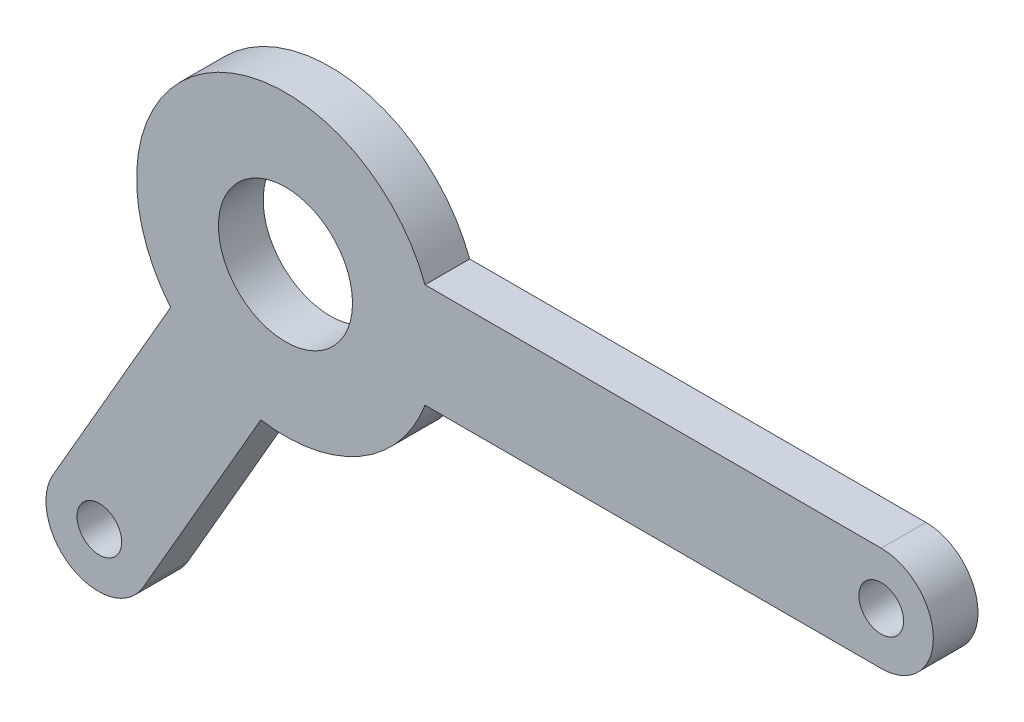
ISO-10303-21;
HEADER;
FILE_DESCRIPTION(('STEP AP214'),'2;1');
FILE_NAME('part.step','',(''),(''),'','','');
FILE_SCHEMA(('AUTOMOTIVE_DESIGN { 1 0 10303 214 1 1 1 1 }'));
ENDSEC;
DATA;
#1=APPLICATION_CONTEXT('core data for automotive mechanical design processes');
#2=APPLICATION_PROTOCOL_DEFINITION('international standard','automotive_design',2000,#1);
#3=PRODUCT_CONTEXT('',#1,'mechanical');
#4=PRODUCT('Part','Part','',(#3));
#5=PRODUCT_RELATED_PRODUCT_CATEGORY('part','',(#4));
#6=PRODUCT_DEFINITION_FORMATION('','',#4);
#7=PRODUCT_DEFINITION_CONTEXT('part definition',#1,'design');
#8=PRODUCT_DEFINITION('design','',#6,#7);
#9=PRODUCT_DEFINITION_SHAPE('','',#8);
#10=(LENGTH_UNIT() NAMED_UNIT(*) SI_UNIT(.MILLI.,.METRE.));
#11=(NAMED_UNIT(*) PLANE_ANGLE_UNIT() SI_UNIT($,.RADIAN.));
#12=(NAMED_UNIT(*) SI_UNIT($,.STERADIAN.) SOLID_ANGLE_UNIT());
#13=UNCERTAINTY_MEASURE_WITH_UNIT(LENGTH_MEASURE(1.E-05),#10,'distance_accuracy_value','');
#14=(GEOMETRIC_REPRESENTATION_CONTEXT(3) GLOBAL_UNCERTAINTY_ASSIGNED_CONTEXT((#13)) GLOBAL_UNIT_ASSIGNED_CONTEXT((#10,
#11,#12)) REPRESENTATION_CONTEXT('',''));
#15=CARTESIAN_POINT('',(0.,0.,0.));
#16=DIRECTION('',(0.,0.,1.));
#17=DIRECTION('',(1.,0.,0.));
#18=AXIS2_PLACEMENT_3D('',#15,#16,#17);
#19=CARTESIAN_POINT('',(200.,0.,15.));
#20=DIRECTION('',(0.,0.,-1.));
#21=DIRECTION('',(-1.,0.,0.));
#22=AXIS2_PLACEMENT_3D('',#19,#20,#21);
#23=PLANE('',#22);
#24=CARTESIAN_POINT('',(200.,0.,15.));
#25=DIRECTION('',(0.,0.,1.));
#26=DIRECTION('',(-1.,0.,0.));
#27=AXIS2_PLACEMENT_3D('',#24,#25,#26);
#28=CIRCLE('',#27,17.5);
#29=CARTESIAN_POINT('',(200.,-17.5,15.));
#30=VERTEX_POINT('',#29);
#31=CARTESIAN_POINT('',(200.,17.5,15.));
#32=VERTEX_POINT('',#31);
#33=EDGE_CURVE('E168',#30,#32,#28,.T.);
#34=ORIENTED_EDGE('',*,*,#33,.T.);
#35=DIRECTION('',(-1.,0.,0.));
#36=VECTOR('',#35,1.);
#37=CARTESIAN_POINT('',(46.837484987988,17.5,15.));
#38=LINE('',#37,#36);
#39=CARTESIAN_POINT('',(46.837484987988,17.5,15.));
#40=VERTEX_POINT('',#39);
#41=EDGE_CURVE('E104',#32,#40,#38,.T.);
#42=ORIENTED_EDGE('',*,*,#41,.T.);
#43=CARTESIAN_POINT('',(0.,0.,15.));
#44=DIRECTION('',(0.,0.,1.));
#45=DIRECTION('',(1.,0.,0.));
#46=AXIS2_PLACEMENT_3D('',#43,#44,#45);
#47=CIRCLE('',#46,50.);
#48=CARTESIAN_POINT('',(-38.5741870602219,-31.8124518489697,15.));
#49=VERTEX_POINT('',#48);
#50=EDGE_CURVE('E189',#40,#49,#47,.T.);
#51=ORIENTED_EDGE('',*,*,#50,.T.);
#52=DIRECTION('',(-0.500000000000004,-0.866025403784436,0.));
#53=VECTOR('',#52,1.);
#54=CARTESIAN_POINT('',(-38.5741870602218,-31.8124518489697,15.));
#55=LINE('',#54,#53);
#56=CARTESIAN_POINT('',(-78.0820940685403,-100.242154088083,15.));
#57=VERTEX_POINT('',#56);
#58=EDGE_CURVE('E203',#49,#57,#55,.T.);
#59=ORIENTED_EDGE('',*,*,#58,.T.);
#60=CARTESIAN_POINT('',(-62.9266495023126,-108.992154088083,15.));
#61=DIRECTION('',(0.,0.,1.));
#62=DIRECTION('',(1.,0.,0.));
#63=AXIS2_PLACEMENT_3D('',#60,#61,#62);
#64=CIRCLE('',#63,17.5);
#65=CARTESIAN_POINT('',(-47.771204936085,-117.742154088083,15.));
#66=VERTEX_POINT('',#65);
#67=EDGE_CURVE('E123',#57,#66,#64,.T.);
#68=ORIENTED_EDGE('',*,*,#67,.T.);
#69=DIRECTION('',(0.500000000000004,0.866025403784436,0.));
#70=VECTOR('',#69,1.);
#71=CARTESIAN_POINT('',(-8.26329792776657,-49.3124518489698,15.));
#72=LINE('',#71,#70);
#73=CARTESIAN_POINT('',(-8.26329792776657,-49.3124518489698,15.));
#74=VERTEX_POINT('',#73);
#75=EDGE_CURVE('E117',#66,#74,#72,.T.);
#76=ORIENTED_EDGE('',*,*,#75,.T.);
#77=CARTESIAN_POINT('',(0.,0.,15.));
#78=DIRECTION('',(0.,0.,1.));
#79=DIRECTION('',(1.,0.,0.));
#80=AXIS2_PLACEMENT_3D('',#77,#78,#79);
#81=CIRCLE('',#80,50.);
#82=CARTESIAN_POINT('',(46.837484987988,-17.5,15.));
#83=VERTEX_POINT('',#82);
#84=EDGE_CURVE('E121',#74,#83,#81,.T.);
#85=ORIENTED_EDGE('',*,*,#84,.T.);
#86=DIRECTION('',(1.,0.,0.));
#87=VECTOR('',#86,1.);
#88=CARTESIAN_POINT('',(200.,-17.5,15.));
#89=LINE('',#88,#87);
#90=EDGE_CURVE('E61',#83,#30,#89,.T.);
#91=ORIENTED_EDGE('',*,*,#90,.T.);
#92=EDGE_LOOP('',(#34,#42,#51,#59,#68,#76,#85,#91));
#93=FACE_BOUND('',#92,.T.);
#94=CARTESIAN_POINT('',(0.,0.,15.));
#95=DIRECTION('',(0.,0.,1.));
#96=DIRECTION('',(1.,0.,0.));
#97=AXIS2_PLACEMENT_3D('',#94,#95,#96);
#98=CIRCLE('',#97,22.5);
#99=CARTESIAN_POINT('',(22.5,0.,15.));
#100=VERTEX_POINT('',#99);
#101=EDGE_CURVE('E150',#100,#100,#98,.T.);
#102=ORIENTED_EDGE('',*,*,#101,.F.);
#103=EDGE_LOOP('',(#102));
#104=FACE_BOUND('',#103,.T.);
#105=CARTESIAN_POINT('',(200.,0.,15.));
#106=DIRECTION('',(0.,0.,1.));
#107=DIRECTION('',(1.,0.,0.));
#108=AXIS2_PLACEMENT_3D('',#105,#106,#107);
#109=CIRCLE('',#108,7.50000000000001);
#110=CARTESIAN_POINT('',(207.5,0.,15.));
#111=VERTEX_POINT('',#110);
#112=EDGE_CURVE('E217',#111,#111,#109,.T.);
#113=ORIENTED_EDGE('',*,*,#112,.F.);
#114=EDGE_LOOP('',(#113));
#115=FACE_BOUND('',#114,.T.);
#116=CARTESIAN_POINT('',(-62.5000000000005,-108.253175473055,15.));
#117=DIRECTION('',(0.,0.,1.));
#118=DIRECTION('',(1.,0.,0.));
#119=AXIS2_PLACEMENT_3D('',#116,#117,#118);
#120=CIRCLE('',#119,7.5);
#121=CARTESIAN_POINT('',(-55.0000000000005,-108.253175473055,15.));
#122=VERTEX_POINT('',#121);
#123=EDGE_CURVE('E225',#122,#122,#120,.T.);
#124=ORIENTED_EDGE('',*,*,#123,.F.);
#125=EDGE_LOOP('',(#124));
#126=FACE_BOUND('',#125,.T.);
#127=ADVANCED_FACE('F43',(#93,#104,#115,#126),#23,.F.);
#128=CARTESIAN_POINT('',(200.,0.,0.));
#129=DIRECTION('',(0.,0.,-1.));
#130=DIRECTION('',(-1.,0.,0.));
#131=AXIS2_PLACEMENT_3D('',#128,#129,#130);
#132=PLANE('',#131);
#133=CARTESIAN_POINT('',(200.,0.,0.));
#134=DIRECTION('',(0.,0.,1.));
#135=DIRECTION('',(1.,0.,0.));
#136=AXIS2_PLACEMENT_3D('',#133,#134,#135);
#137=CIRCLE('',#136,7.50000000000001);
#138=CARTESIAN_POINT('',(207.5,0.,0.));
#139=VERTEX_POINT('',#138);
#140=EDGE_CURVE('E221',#139,#139,#137,.T.);
#141=ORIENTED_EDGE('',*,*,#140,.T.);
#142=EDGE_LOOP('',(#141));
#143=FACE_BOUND('',#142,.T.);
#144=CARTESIAN_POINT('',(200.,0.,0.));
#145=DIRECTION('',(0.,0.,1.));
#146=DIRECTION('',(-1.,0.,0.));
#147=AXIS2_PLACEMENT_3D('',#144,#145,#146);
#148=CIRCLE('',#147,17.5);
#149=CARTESIAN_POINT('',(200.,-17.5,0.));
#150=VERTEX_POINT('',#149);
#151=CARTESIAN_POINT('',(200.,17.5,0.));
#152=VERTEX_POINT('',#151);
#153=EDGE_CURVE('E145',#150,#152,#148,.T.);
#154=ORIENTED_EDGE('',*,*,#153,.F.);
#155=DIRECTION('',(1.,0.,0.));
#156=VECTOR('',#155,1.);
#157=CARTESIAN_POINT('',(200.,-17.5,0.));
#158=LINE('',#157,#156);
#159=CARTESIAN_POINT('',(46.837484987988,-17.5,0.));
#160=VERTEX_POINT('',#159);
#161=EDGE_CURVE('E96',#160,#150,#158,.T.);
#162=ORIENTED_EDGE('',*,*,#161,.F.);
#163=CARTESIAN_POINT('',(0.,0.,0.));
#164=DIRECTION('',(0.,0.,1.));
#165=DIRECTION('',(1.,0.,0.));
#166=AXIS2_PLACEMENT_3D('',#163,#164,#165);
#167=CIRCLE('',#166,50.);
#168=CARTESIAN_POINT('',(-8.26329792776657,-49.3124518489698,0.));
#169=VERTEX_POINT('',#168);
#170=EDGE_CURVE('E90',#169,#160,#167,.T.);
#171=ORIENTED_EDGE('',*,*,#170,.F.);
#172=DIRECTION('',(0.500000000000004,0.866025403784436,0.));
#173=VECTOR('',#172,1.);
#174=CARTESIAN_POINT('',(-8.26329792776657,-49.3124518489698,0.));
#175=LINE('',#174,#173);
#176=CARTESIAN_POINT('',(-47.771204936085,-117.742154088083,0.));
#177=VERTEX_POINT('',#176);
#178=EDGE_CURVE('E132',#177,#169,#175,.T.);
#179=ORIENTED_EDGE('',*,*,#178,.F.);
#180=CARTESIAN_POINT('',(-62.9266495023126,-108.992154088083,0.));
#181=DIRECTION('',(0.,0.,1.));
#182=DIRECTION('',(1.,0.,0.));
#183=AXIS2_PLACEMENT_3D('',#180,#181,#182);
#184=CIRCLE('',#183,17.5);
#185=CARTESIAN_POINT('',(-78.0820940685403,-100.242154088083,0.));
#186=VERTEX_POINT('',#185);
#187=EDGE_CURVE('E159',#186,#177,#184,.T.);
#188=ORIENTED_EDGE('',*,*,#187,.F.);
#189=DIRECTION('',(-0.500000000000004,-0.866025403784436,0.));
#190=VECTOR('',#189,1.);
#191=CARTESIAN_POINT('',(-38.5741870602218,-31.8124518489697,0.));
#192=LINE('',#191,#190);
#193=CARTESIAN_POINT('',(-38.5741870602219,-31.8124518489697,0.));
#194=VERTEX_POINT('',#193);
#195=EDGE_CURVE('E156',#194,#186,#192,.T.);
#196=ORIENTED_EDGE('',*,*,#195,.F.);
#197=CARTESIAN_POINT('',(0.,0.,0.));
#198=DIRECTION('',(0.,0.,1.));
#199=DIRECTION('',(1.,0.,0.));
#200=AXIS2_PLACEMENT_3D('',#197,#198,#199);
#201=CIRCLE('',#200,50.);
#202=CARTESIAN_POINT('',(46.837484987988,17.5,0.));
#203=VERTEX_POINT('',#202);
#204=EDGE_CURVE('E153',#203,#194,#201,.T.);
#205=ORIENTED_EDGE('',*,*,#204,.F.);
#206=DIRECTION('',(-1.,0.,0.));
#207=VECTOR('',#206,1.);
#208=CARTESIAN_POINT('',(46.837484987988,17.5,0.));
#209=LINE('',#208,#207);
#210=EDGE_CURVE('E149',#152,#203,#209,.T.);
#211=ORIENTED_EDGE('',*,*,#210,.F.);
#212=EDGE_LOOP('',(#154,#162,#171,#179,#188,#196,#205,#211));
#213=FACE_BOUND('',#212,.T.);
#214=CARTESIAN_POINT('',(0.,0.,0.));
#215=DIRECTION('',(0.,0.,1.));
#216=DIRECTION('',(1.,0.,0.));
#217=AXIS2_PLACEMENT_3D('',#214,#215,#216);
#218=CIRCLE('',#217,22.5);
#219=CARTESIAN_POINT('',(22.5,0.,0.));
#220=VERTEX_POINT('',#219);
#221=EDGE_CURVE('E213',#220,#220,#218,.T.);
#222=ORIENTED_EDGE('',*,*,#221,.T.);
#223=EDGE_LOOP('',(#222));
#224=FACE_BOUND('',#223,.T.);
#225=CARTESIAN_POINT('',(-62.5000000000005,-108.253175473055,0.));
#226=DIRECTION('',(0.,0.,1.));
#227=DIRECTION('',(1.,0.,0.));
#228=AXIS2_PLACEMENT_3D('',#225,#226,#227);
#229=CIRCLE('',#228,7.5);
#230=CARTESIAN_POINT('',(-55.0000000000005,-108.253175473055,0.));
#231=VERTEX_POINT('',#230);
#232=EDGE_CURVE('E229',#231,#231,#229,.T.);
#233=ORIENTED_EDGE('',*,*,#232,.T.);
#234=EDGE_LOOP('',(#233));
#235=FACE_BOUND('',#234,.T.);
#236=ADVANCED_FACE('F193',(#143,#213,#224,#235),#132,.T.);
#237=CARTESIAN_POINT('',(200.,0.,15.));
#238=DIRECTION('',(0.,0.,-1.));
#239=DIRECTION('',(-1.,0.,0.));
#240=AXIS2_PLACEMENT_3D('',#237,#238,#239);
#241=CYLINDRICAL_SURFACE('',#240,17.5);
#242=ORIENTED_EDGE('',*,*,#153,.T.);
#243=DIRECTION('',(0.,0.,-1.));
#244=VECTOR('',#243,1.);
#245=CARTESIAN_POINT('',(200.,17.5,15.));
#246=LINE('',#245,#244);
#247=EDGE_CURVE('E11',#32,#152,#246,.T.);
#248=ORIENTED_EDGE('',*,*,#247,.F.);
#249=ORIENTED_EDGE('',*,*,#33,.F.);
#250=DIRECTION('',(0.,0.,-1.));
#251=VECTOR('',#250,1.);
#252=CARTESIAN_POINT('',(200.,-17.5,15.));
#253=LINE('',#252,#251);
#254=EDGE_CURVE('E141',#30,#150,#253,.T.);
#255=ORIENTED_EDGE('',*,*,#254,.T.);
#256=EDGE_LOOP('',(#242,#248,#249,#255));
#257=FACE_BOUND('',#256,.T.);
#258=ADVANCED_FACE('F45',(#257),#241,.T.);
#259=CARTESIAN_POINT('',(46.837484987988,17.5,15.));
#260=DIRECTION('',(0.,-1.,0.));
#261=DIRECTION('',(1.,0.,0.));
#262=AXIS2_PLACEMENT_3D('',#259,#260,#261);
#263=PLANE('',#262);
#264=ORIENTED_EDGE('',*,*,#210,.T.);
#265=DIRECTION('',(0.,0.,-1.));
#266=VECTOR('',#265,1.);
#267=CARTESIAN_POINT('',(46.837484987988,17.5,15.));
#268=LINE('',#267,#266);
#269=EDGE_CURVE('E53',#40,#203,#268,.T.);
#270=ORIENTED_EDGE('',*,*,#269,.F.);
#271=ORIENTED_EDGE('',*,*,#41,.F.);
#272=ORIENTED_EDGE('',*,*,#247,.T.);
#273=EDGE_LOOP('',(#264,#270,#271,#272));
#274=FACE_BOUND('',#273,.T.);
#275=ADVANCED_FACE('F263',(#274),#263,.F.);
#276=CARTESIAN_POINT('',(0.,0.,15.));
#277=DIRECTION('',(0.,0.,-1.));
#278=DIRECTION('',(-1.,0.,0.));
#279=AXIS2_PLACEMENT_3D('',#276,#277,#278);
#280=CYLINDRICAL_SURFACE('',#279,50.);
#281=ORIENTED_EDGE('',*,*,#204,.T.);
#282=DIRECTION('',(0.,0.,-1.));
#283=VECTOR('',#282,1.);
#284=CARTESIAN_POINT('',(-38.5741870602219,-31.8124518489697,15.));
#285=LINE('',#284,#283);
#286=EDGE_CURVE('E179',#49,#194,#285,.T.);
#287=ORIENTED_EDGE('',*,*,#286,.F.);
#288=ORIENTED_EDGE('',*,*,#50,.F.);
#289=ORIENTED_EDGE('',*,*,#269,.T.);
#290=EDGE_LOOP('',(#281,#287,#288,#289));
#291=FACE_BOUND('',#290,.T.);
#292=ADVANCED_FACE('F187',(#291),#280,.T.);
#293=CARTESIAN_POINT('',(-38.5741870602218,-31.8124518489697,15.));
#294=DIRECTION('',(0.866025403784436,-0.500000000000004,0.));
#295=DIRECTION('',(0.500000000000004,0.866025403784436,0.));
#296=AXIS2_PLACEMENT_3D('',#293,#294,#295);
#297=PLANE('',#296);
#298=ORIENTED_EDGE('',*,*,#195,.T.);
#299=DIRECTION('',(0.,0.,-1.));
#300=VECTOR('',#299,1.);
#301=CARTESIAN_POINT('',(-78.0820940685403,-100.242154088083,15.));
#302=LINE('',#301,#300);
#303=EDGE_CURVE('E175',#57,#186,#302,.T.);
#304=ORIENTED_EDGE('',*,*,#303,.F.);
#305=ORIENTED_EDGE('',*,*,#58,.F.);
#306=ORIENTED_EDGE('',*,*,#286,.T.);
#307=EDGE_LOOP('',(#298,#304,#305,#306));
#308=FACE_BOUND('',#307,.T.);
#309=ADVANCED_FACE('F198',(#308),#297,.F.);
#310=CARTESIAN_POINT('',(-62.9266495023126,-108.992154088083,15.));
#311=DIRECTION('',(0.,0.,-1.));
#312=DIRECTION('',(-1.,0.,0.));
#313=AXIS2_PLACEMENT_3D('',#310,#311,#312);
#314=CYLINDRICAL_SURFACE('',#313,17.5);
#315=ORIENTED_EDGE('',*,*,#187,.T.);
#316=DIRECTION('',(0.,0.,-1.));
#317=VECTOR('',#316,1.);
#318=CARTESIAN_POINT('',(-47.771204936085,-117.742154088083,15.));
#319=LINE('',#318,#317);
#320=EDGE_CURVE('E134',#66,#177,#319,.T.);
#321=ORIENTED_EDGE('',*,*,#320,.F.);
#322=ORIENTED_EDGE('',*,*,#67,.F.);
#323=ORIENTED_EDGE('',*,*,#303,.T.);
#324=EDGE_LOOP('',(#315,#321,#322,#323));
#325=FACE_BOUND('',#324,.T.);
#326=ADVANCED_FACE('F201',(#325),#314,.T.);
#327=CARTESIAN_POINT('',(-8.26329792776657,-49.3124518489698,15.));
#328=DIRECTION('',(-0.866025403784436,0.500000000000004,0.));
#329=DIRECTION('',(-0.500000000000004,-0.866025403784436,0.));
#330=AXIS2_PLACEMENT_3D('',#327,#328,#329);
#331=PLANE('',#330);
#332=ORIENTED_EDGE('',*,*,#178,.T.);
#333=DIRECTION('',(0.,0.,-1.));
#334=VECTOR('',#333,1.);
#335=CARTESIAN_POINT('',(-8.26329792776657,-49.3124518489698,15.));
#336=LINE('',#335,#334);
#337=EDGE_CURVE('E129',#74,#169,#336,.T.);
#338=ORIENTED_EDGE('',*,*,#337,.F.);
#339=ORIENTED_EDGE('',*,*,#75,.F.);
#340=ORIENTED_EDGE('',*,*,#320,.T.);
#341=EDGE_LOOP('',(#332,#338,#339,#340));
#342=FACE_BOUND('',#341,.T.);
#343=ADVANCED_FACE('F130',(#342),#331,.F.);
#344=CARTESIAN_POINT('',(0.,0.,15.));
#345=DIRECTION('',(0.,0.,-1.));
#346=DIRECTION('',(-1.,0.,0.));
#347=AXIS2_PLACEMENT_3D('',#344,#345,#346);
#348=CYLINDRICAL_SURFACE('',#347,50.);
#349=ORIENTED_EDGE('',*,*,#170,.T.);
#350=DIRECTION('',(0.,0.,-1.));
#351=VECTOR('',#350,1.);
#352=CARTESIAN_POINT('',(46.837484987988,-17.5,15.));
#353=LINE('',#352,#351);
#354=EDGE_CURVE('E135',#83,#160,#353,.T.);
#355=ORIENTED_EDGE('',*,*,#354,.F.);
#356=ORIENTED_EDGE('',*,*,#84,.F.);
#357=ORIENTED_EDGE('',*,*,#337,.T.);
#358=EDGE_LOOP('',(#349,#355,#356,#357));
#359=FACE_BOUND('',#358,.T.);
#360=ADVANCED_FACE('F137',(#359),#348,.T.);
#361=CARTESIAN_POINT('',(200.,-17.5,15.));
#362=DIRECTION('',(0.,1.,0.));
#363=DIRECTION('',(-1.,0.,0.));
#364=AXIS2_PLACEMENT_3D('',#361,#362,#363);
#365=PLANE('',#364);
#366=ORIENTED_EDGE('',*,*,#161,.T.);
#367=ORIENTED_EDGE('',*,*,#254,.F.);
#368=ORIENTED_EDGE('',*,*,#90,.F.);
#369=ORIENTED_EDGE('',*,*,#354,.T.);
#370=EDGE_LOOP('',(#366,#367,#368,#369));
#371=FACE_BOUND('',#370,.T.);
#372=ADVANCED_FACE('F251',(#371),#365,.F.);
#373=CARTESIAN_POINT('',(0.,0.,15.));
#374=DIRECTION('',(0.,0.,-1.));
#375=DIRECTION('',(-1.,0.,0.));
#376=AXIS2_PLACEMENT_3D('',#373,#374,#375);
#377=CYLINDRICAL_SURFACE('',#376,22.5);
#378=ORIENTED_EDGE('',*,*,#101,.T.);
#379=EDGE_LOOP('',(#378));
#380=FACE_BOUND('',#379,.T.);
#381=ORIENTED_EDGE('',*,*,#221,.F.);
#382=EDGE_LOOP('',(#381));
#383=FACE_BOUND('',#382,.T.);
#384=ADVANCED_FACE('F248',(#380,#383),#377,.F.);
#385=CARTESIAN_POINT('',(200.,0.,15.));
#386=DIRECTION('',(0.,0.,-1.));
#387=DIRECTION('',(-1.,0.,0.));
#388=AXIS2_PLACEMENT_3D('',#385,#386,#387);
#389=CYLINDRICAL_SURFACE('',#388,7.50000000000001);
#390=ORIENTED_EDGE('',*,*,#112,.T.);
#391=EDGE_LOOP('',(#390));
#392=FACE_BOUND('',#391,.T.);
#393=ORIENTED_EDGE('',*,*,#140,.F.);
#394=EDGE_LOOP('',(#393));
#395=FACE_BOUND('',#394,.T.);
#396=ADVANCED_FACE('F339',(#392,#395),#389,.F.);
#397=CARTESIAN_POINT('',(-62.5000000000005,-108.253175473055,15.));
#398=DIRECTION('',(0.,0.,-1.));
#399=DIRECTION('',(-1.,0.,0.));
#400=AXIS2_PLACEMENT_3D('',#397,#398,#399);
#401=CYLINDRICAL_SURFACE('',#400,7.5);
#402=ORIENTED_EDGE('',*,*,#123,.T.);
#403=EDGE_LOOP('',(#402));
#404=FACE_BOUND('',#403,.T.);
#405=ORIENTED_EDGE('',*,*,#232,.F.);
#406=EDGE_LOOP('',(#405));
#407=FACE_BOUND('',#406,.T.);
#408=ADVANCED_FACE('F237',(#404,#407),#401,.F.);
#409=CLOSED_SHELL('',(#127,#236,#258,#275,#292,#309,#326,#343,#360,#372,#384,#396,#408));
#410=MANIFOLD_SOLID_BREP('B2',#409);
#411=ADVANCED_BREP_SHAPE_REPRESENTATION('',(#18,#410),#14);
#412=SHAPE_DEFINITION_REPRESENTATION(#9,#411);
ENDSEC;
END-ISO-10303-21;
